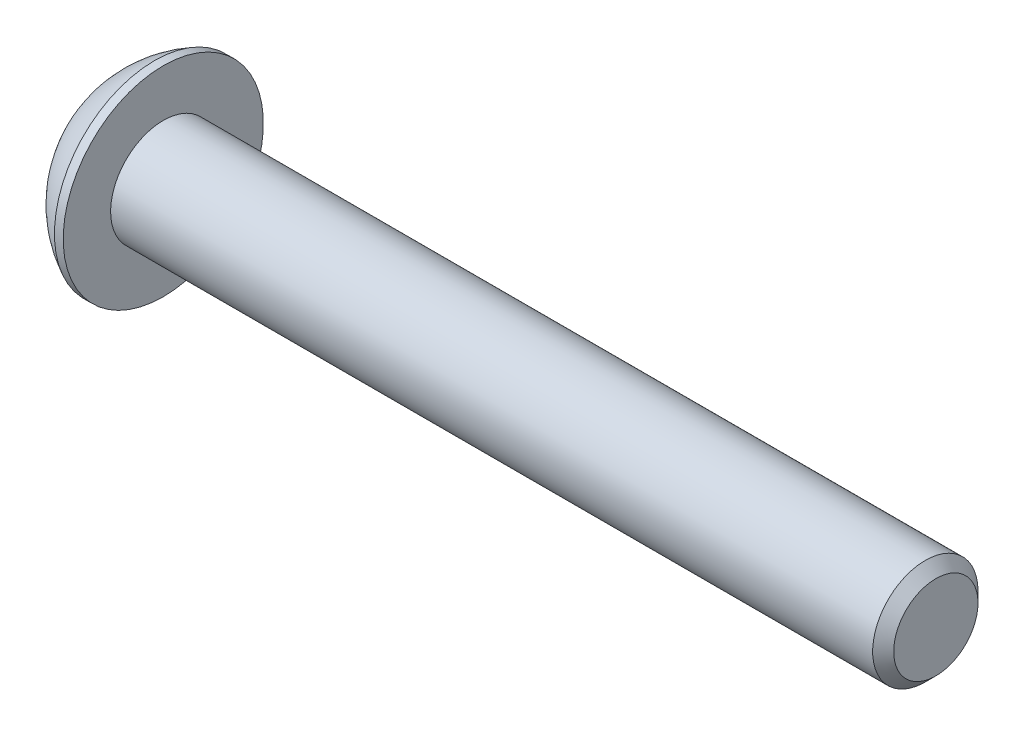
ISO-10303-21;
HEADER;
FILE_DESCRIPTION(('STEP AP214'),'2;1');
FILE_NAME('part.step','',(''),(''),'','','');
FILE_SCHEMA(('AUTOMOTIVE_DESIGN { 1 0 10303 214 1 1 1 1 }'));
ENDSEC;
DATA;
#1=APPLICATION_CONTEXT('core data for automotive mechanical design processes');
#2=APPLICATION_PROTOCOL_DEFINITION('international standard','automotive_design',2000,#1);
#3=PRODUCT_CONTEXT('',#1,'mechanical');
#4=PRODUCT('Part','Part','',(#3));
#5=PRODUCT_RELATED_PRODUCT_CATEGORY('part','',(#4));
#6=PRODUCT_DEFINITION_FORMATION('','',#4);
#7=PRODUCT_DEFINITION_CONTEXT('part definition',#1,'design');
#8=PRODUCT_DEFINITION('design','',#6,#7);
#9=PRODUCT_DEFINITION_SHAPE('','',#8);
#10=(LENGTH_UNIT() NAMED_UNIT(*) SI_UNIT(.MILLI.,.METRE.));
#11=(NAMED_UNIT(*) PLANE_ANGLE_UNIT() SI_UNIT($,.RADIAN.));
#12=(NAMED_UNIT(*) SI_UNIT($,.STERADIAN.) SOLID_ANGLE_UNIT());
#13=UNCERTAINTY_MEASURE_WITH_UNIT(LENGTH_MEASURE(1.E-05),#10,'distance_accuracy_value','');
#14=(GEOMETRIC_REPRESENTATION_CONTEXT(3) GLOBAL_UNCERTAINTY_ASSIGNED_CONTEXT((#13)) GLOBAL_UNIT_ASSIGNED_CONTEXT((#10,
#11,#12)) REPRESENTATION_CONTEXT('',''));
#15=CARTESIAN_POINT('',(0.,0.,0.));
#16=DIRECTION('',(0.,0.,1.));
#17=DIRECTION('',(1.,0.,0.));
#18=AXIS2_PLACEMENT_3D('',#15,#16,#17);
#19=CARTESIAN_POINT('',(-22.,0.,0.));
#20=DIRECTION('',(1.,0.,0.));
#21=DIRECTION('',(0.,0.,-1.));
#22=AXIS2_PLACEMENT_3D('',#19,#20,#21);
#23=CYLINDRICAL_SURFACE('',#22,1.5);
#24=CARTESIAN_POINT('',(-0.300000000000002,0.,0.));
#25=DIRECTION('',(1.,0.,0.));
#26=DIRECTION('',(0.,0.,-1.));
#27=AXIS2_PLACEMENT_3D('',#24,#25,#26);
#28=CIRCLE('',#27,1.5);
#29=CARTESIAN_POINT('',(-0.300000000000002,0.,-1.5));
#30=VERTEX_POINT('',#29);
#31=EDGE_CURVE('E48',#30,#30,#28,.F.);
#32=ORIENTED_EDGE('',*,*,#31,.T.);
#33=EDGE_LOOP('',(#32));
#34=FACE_BOUND('',#33,.T.);
#35=CARTESIAN_POINT('',(-22.,0.,0.));
#36=DIRECTION('',(-1.,0.,0.));
#37=DIRECTION('',(0.,-1.,0.));
#38=AXIS2_PLACEMENT_3D('',#35,#36,#37);
#39=CIRCLE('',#38,1.5);
#40=CARTESIAN_POINT('',(-22.,-1.50000000000001,0.));
#41=VERTEX_POINT('',#40);
#42=EDGE_CURVE('E131',#41,#41,#39,.F.);
#43=ORIENTED_EDGE('',*,*,#42,.T.);
#44=EDGE_LOOP('',(#43));
#45=FACE_BOUND('',#44,.T.);
#46=ADVANCED_FACE('F35',(#34,#45),#23,.T.);
#47=CARTESIAN_POINT('',(0.,0.,0.));
#48=DIRECTION('',(1.,0.,0.));
#49=DIRECTION('',(0.,0.,-1.));
#50=AXIS2_PLACEMENT_3D('',#47,#48,#49);
#51=PLANE('',#50);
#52=CARTESIAN_POINT('',(0.,0.,0.));
#53=DIRECTION('',(1.,0.,0.));
#54=DIRECTION('',(0.,0.,-1.));
#55=AXIS2_PLACEMENT_3D('',#52,#53,#54);
#56=CIRCLE('',#55,1.2);
#57=CARTESIAN_POINT('',(0.,0.,-1.2));
#58=VERTEX_POINT('',#57);
#59=EDGE_CURVE('E135',#58,#58,#56,.T.);
#60=ORIENTED_EDGE('',*,*,#59,.T.);
#61=EDGE_LOOP('',(#60));
#62=FACE_BOUND('',#61,.T.);
#63=ADVANCED_FACE('F150',(#62),#51,.T.);
#64=CARTESIAN_POINT('',(0.,0.,0.));
#65=DIRECTION('',(-1.,0.,0.));
#66=DIRECTION('',(0.,0.,1.));
#67=AXIS2_PLACEMENT_3D('',#64,#65,#66);
#68=CONICAL_SURFACE('',#67,1.2,0.785398163397452);
#69=ORIENTED_EDGE('',*,*,#31,.F.);
#70=EDGE_LOOP('',(#69));
#71=FACE_BOUND('',#70,.T.);
#72=ORIENTED_EDGE('',*,*,#59,.F.);
#73=EDGE_LOOP('',(#72));
#74=FACE_BOUND('',#73,.T.);
#75=ADVANCED_FACE('F37',(#71,#74),#68,.T.);
#76=CARTESIAN_POINT('',(-23.65,0.,0.));
#77=DIRECTION('',(1.,0.,0.));
#78=DIRECTION('',(0.,1.,0.));
#79=AXIS2_PLACEMENT_3D('',#76,#77,#78);
#80=PLANE('',#79);
#81=CARTESIAN_POINT('',(-23.65,0.,0.));
#82=DIRECTION('',(-1.,0.,0.));
#83=DIRECTION('',(0.,-1.,0.));
#84=AXIS2_PLACEMENT_3D('',#81,#82,#83);
#85=CIRCLE('',#84,1.20470053837925);
#86=CARTESIAN_POINT('',(-23.65,-1.20470053837923,0.));
#87=VERTEX_POINT('',#86);
#88=EDGE_CURVE('E373',#87,#87,#85,.T.);
#89=ORIENTED_EDGE('',*,*,#88,.F.);
#90=EDGE_LOOP('',(#89));
#91=FACE_BOUND('',#90,.T.);
#92=CARTESIAN_POINT('',(-23.65,0.,0.));
#93=DIRECTION('',(-1.,0.,0.));
#94=DIRECTION('',(0.,-1.,0.));
#95=AXIS2_PLACEMENT_3D('',#92,#93,#94);
#96=CIRCLE('',#95,1.5);
#97=CARTESIAN_POINT('',(-23.65,-1.5,0.));
#98=VERTEX_POINT('',#97);
#99=EDGE_CURVE('E127',#98,#98,#96,.T.);
#100=ORIENTED_EDGE('',*,*,#99,.T.);
#101=EDGE_LOOP('',(#100));
#102=FACE_BOUND('',#101,.T.);
#103=ADVANCED_FACE('F149',(#91,#102),#80,.F.);
#104=CARTESIAN_POINT('',(-20.8526785714286,0.,0.));
#105=DIRECTION('',(-1.,0.,0.));
#106=DIRECTION('',(0.,1.,0.));
#107=AXIS2_PLACEMENT_3D('',#104,#105,#106);
#108=SPHERICAL_SURFACE('',#107,3.17411517981703);
#109=ORIENTED_EDGE('',*,*,#99,.F.);
#110=EDGE_LOOP('',(#109));
#111=FACE_BOUND('',#110,.T.);
#112=CARTESIAN_POINT('',(-22.25,0.,0.));
#113=DIRECTION('',(-1.,0.,0.));
#114=DIRECTION('',(0.,-1.,0.));
#115=AXIS2_PLACEMENT_3D('',#112,#113,#114);
#116=CIRCLE('',#115,2.85);
#117=CARTESIAN_POINT('',(-22.25,-2.85,0.));
#118=VERTEX_POINT('',#117);
#119=EDGE_CURVE('E123',#118,#118,#116,.T.);
#120=ORIENTED_EDGE('',*,*,#119,.T.);
#121=EDGE_LOOP('',(#120));
#122=FACE_BOUND('',#121,.T.);
#123=ADVANCED_FACE('F161',(#111,#122),#108,.T.);
#124=CARTESIAN_POINT('',(-22.,0.,0.));
#125=DIRECTION('',(-1.,0.,0.));
#126=DIRECTION('',(0.,-1.,0.));
#127=AXIS2_PLACEMENT_3D('',#124,#125,#126);
#128=CYLINDRICAL_SURFACE('',#127,2.85);
#129=ORIENTED_EDGE('',*,*,#119,.F.);
#130=EDGE_LOOP('',(#129));
#131=FACE_BOUND('',#130,.T.);
#132=CARTESIAN_POINT('',(-22.,0.,0.));
#133=DIRECTION('',(-1.,0.,0.));
#134=DIRECTION('',(0.,-1.,0.));
#135=AXIS2_PLACEMENT_3D('',#132,#133,#134);
#136=CIRCLE('',#135,2.85);
#137=CARTESIAN_POINT('',(-22.,-2.85,0.));
#138=VERTEX_POINT('',#137);
#139=EDGE_CURVE('E119',#138,#138,#136,.T.);
#140=ORIENTED_EDGE('',*,*,#139,.T.);
#141=EDGE_LOOP('',(#140));
#142=FACE_BOUND('',#141,.T.);
#143=ADVANCED_FACE('F165',(#131,#142),#128,.T.);
#144=CARTESIAN_POINT('',(-22.,2.85,0.));
#145=DIRECTION('',(-1.,0.,0.));
#146=DIRECTION('',(0.,-1.,0.));
#147=AXIS2_PLACEMENT_3D('',#144,#145,#146);
#148=PLANE('',#147);
#149=ORIENTED_EDGE('',*,*,#42,.F.);
#150=EDGE_LOOP('',(#149));
#151=FACE_BOUND('',#150,.T.);
#152=ORIENTED_EDGE('',*,*,#139,.F.);
#153=EDGE_LOOP('',(#152));
#154=FACE_BOUND('',#153,.T.);
#155=ADVANCED_FACE('F169',(#151,#154),#148,.F.);
#156=CARTESIAN_POINT('',(-23.65,0.,0.));
#157=DIRECTION('',(-1.,0.,0.));
#158=DIRECTION('',(0.,-1.,0.));
#159=AXIS2_PLACEMENT_3D('',#156,#157,#158);
#160=CONICAL_SURFACE('',#159,1.20470053837925,0.78539816339745);
#161=ORIENTED_EDGE('',*,*,#88,.T.);
#162=EDGE_LOOP('',(#161));
#163=FACE_BOUND('',#162,.T.);
#164=CARTESIAN_POINT('',(-24.0125645579163,-1.20678079288094,1.));
#165=CARTESIAN_POINT('',(-23.9901238799752,-1.17763239380935,1.));
#166=CARTESIAN_POINT('',(-23.9678867609271,-1.14832777655036,1.));
#167=CARTESIAN_POINT('',(-23.9239053230859,-1.08934073997338,1.));
#168=CARTESIAN_POINT('',(-23.902161120887,-1.05965823380993,1.));
#169=CARTESIAN_POINT('',(-23.8374858802222,-0.969511619364356,1.));
#170=CARTESIAN_POINT('',(-23.795456442765,-0.908390032886386,1.));
#171=CARTESIAN_POINT('',(-23.7124203349119,-0.779849899214012,1.));
#172=CARTESIAN_POINT('',(-23.6716484956871,-0.712278047733941,1.));
#173=CARTESIAN_POINT('',(-23.5967056855402,-0.573692441836158,1.));
#174=CARTESIAN_POINT('',(-23.5625124208036,-0.50269137003357,1.));
#175=CARTESIAN_POINT('',(-23.5206648240494,-0.396633108483649,1.));
#176=CARTESIAN_POINT('',(-23.5087524246011,-0.363265114723077,1.));
#177=CARTESIAN_POINT('',(-23.4876010580815,-0.295675144863674,1.));
#178=CARTESIAN_POINT('',(-23.4783622608543,-0.261453114661014,1.));
#179=CARTESIAN_POINT('',(-23.4632108375931,-0.192964714439408,1.));
#180=CARTESIAN_POINT('',(-23.4572372079353,-0.158712062702413,1.));
#181=CARTESIAN_POINT('',(-23.4487381792859,-0.089767898959771,1.));
#182=CARTESIAN_POINT('',(-23.4462131691607,-0.0550763379077727,1.));
#183=CARTESIAN_POINT('',(-23.4448308242394,0.0128534343372197,1.));
#184=CARTESIAN_POINT('',(-23.4458171333425,0.0460884918414852,1.));
#185=CARTESIAN_POINT('',(-23.4510428296463,0.112288777523373,1.));
#186=CARTESIAN_POINT('',(-23.4552814228284,0.145254069576946,1.));
#187=CARTESIAN_POINT('',(-23.4668431932388,0.211252641710492,1.));
#188=CARTESIAN_POINT('',(-23.4742213991969,0.244276126106436,1.));
#189=CARTESIAN_POINT('',(-23.4916537633013,0.309593416178925,1.));
#190=CARTESIAN_POINT('',(-23.5017077720937,0.341887262472155,1.));
#191=CARTESIAN_POINT('',(-23.5364692676108,0.441188556116734,1.));
#192=CARTESIAN_POINT('',(-23.5650343603337,0.506841480843505,1.));
#193=CARTESIAN_POINT('',(-23.6286033694253,0.635081389212392,1.));
#194=CARTESIAN_POINT('',(-23.663629955309,0.697656564069552,1.));
#195=CARTESIAN_POINT('',(-23.7359546107891,0.817274369694641,1.));
#196=CARTESIAN_POINT('',(-23.7730556162911,0.874437672313609,1.));
#197=CARTESIAN_POINT('',(-23.8304371678966,0.958655710303513,1.));
#198=CARTESIAN_POINT('',(-23.8497720189249,0.98636616376698,1.));
#199=CARTESIAN_POINT('',(-23.8889602713879,1.04140691974412,1.));
#200=CARTESIAN_POINT('',(-23.908813529201,1.06873732439884,1.));
#201=CARTESIAN_POINT('',(-23.92888195229,1.09590921458872,1.));
#202=B_SPLINE_CURVE_WITH_KNOTS('',3,(#164,#165,#166,#167,#168,#169,#170,#171,#172,#173,#174,
#175,#176,#177,#178,#179,#180,#181,#182,#183,#184,#185,#186,#187,#188,#189,#190,#191,#192,#193,
#194,#195,#196,#197,#198,#199,#200,#201),.UNSPECIFIED.,.F.,.F.,(4,2,2,2,2,2,2,2,2,2,2,2,2,2,2,2,
2,2,4),(0.,0.110355487284535,0.220736811203827,0.443178348562912,0.679759335181115,
0.915523888816459,1.02172703810024,1.12793693259619,1.23208803653002,1.33625088357216,
1.43583459192534,1.53539399546241,1.63677534642523,1.73815103982915,1.95232008261278,
2.16725532249797,2.37159620059983,2.47295962852456,2.57429526618464),.UNSPECIFIED.);
#203=CARTESIAN_POINT('',(-23.6,-0.577350269189611,1.));
#204=VERTEX_POINT('',#203);
#205=CARTESIAN_POINT('',(-23.6,0.577350269189642,1.));
#206=VERTEX_POINT('',#205);
#207=EDGE_CURVE('E103',#204,#206,#202,.T.);
#208=ORIENTED_EDGE('',*,*,#207,.F.);
#209=CARTESIAN_POINT('',(-23.6001154873726,-1.15481600843307,-0.000200000000000398));
#210=CARTESIAN_POINT('',(-23.5802779308257,-1.13496520795024,0.0341825950071799));
#211=CARTESIAN_POINT('',(-23.5616050206389,-1.11478247255941,0.0691401181398245));
#212=CARTESIAN_POINT('',(-23.5274147427232,-1.07362739529218,0.14042280295609));
#213=CARTESIAN_POINT('',(-23.5119164090235,-1.05265113558078,0.176754750528984));
#214=CARTESIAN_POINT('',(-23.4853673071423,-1.01035337909802,0.250016613803311));
#215=CARTESIAN_POINT('',(-23.4742497739969,-0.989042666109225,0.286927851445414));
#216=CARTESIAN_POINT('',(-23.4571198657762,-0.945952199282676,0.361562729310859));
#217=CARTESIAN_POINT('',(-23.4510946974667,-0.924173762626581,0.399284088108635));
#218=CARTESIAN_POINT('',(-23.4456605549675,-0.886641312639999,0.464292198417933));
#219=CARTESIAN_POINT('',(-23.4448569383167,-0.870936130672261,0.491494371528171));
#220=CARTESIAN_POINT('',(-23.4462066994169,-0.839556179862833,0.545846040669112));
#221=CARTESIAN_POINT('',(-23.4483607295472,-0.823881418494909,0.572995523754875));
#222=CARTESIAN_POINT('',(-23.4591169721285,-0.777080970599352,0.65405627732696));
#223=CARTESIAN_POINT('',(-23.4720145564154,-0.746188191116416,0.707564140978427));
#224=CARTESIAN_POINT('',(-23.5031407306022,-0.691968116419635,0.801476065143431));
#225=CARTESIAN_POINT('',(-23.5197377977018,-0.668386557293357,0.842320523671834));
#226=CARTESIAN_POINT('',(-23.5571249246853,-0.622147085933667,0.922409637381943));
#227=CARTESIAN_POINT('',(-23.5779013418174,-0.599486449584561,0.961659010870437));
#228=CARTESIAN_POINT('',(-23.6001154873726,-0.577234799135774,1.0002));
#229=B_SPLINE_CURVE_WITH_KNOTS('',3,(#209,#210,#211,#212,#213,#214,#215,#216,#217,#218,#219,
#220,#221,#222,#223,#224,#225,#226,#227,#228),.UNSPECIFIED.,.F.,.F.,(4,2,2,2,2,2,2,2,2,4),(0.,
0.13323767682856,0.26725222983449,0.399137076269299,0.530689603280767,0.624814864263845,
0.718960890149132,0.907306626112096,1.05710100361789,1.20641411519286),.UNSPECIFIED.);
#230=CARTESIAN_POINT('',(-23.6,-1.15470053837924,0.));
#231=VERTEX_POINT('',#230);
#232=EDGE_CURVE('E211',#231,#204,#229,.T.);
#233=ORIENTED_EDGE('',*,*,#232,.F.);
#234=CARTESIAN_POINT('',(-23.6001154873726,-0.577234799135773,-1.0002));
#235=CARTESIAN_POINT('',(-23.5802779308257,-0.597085599618607,-0.965817404992819));
#236=CARTESIAN_POINT('',(-23.5616050206389,-0.617268335009442,-0.930859881860174));
#237=CARTESIAN_POINT('',(-23.5274147427232,-0.658423412276671,-0.85957719704391));
#238=CARTESIAN_POINT('',(-23.5119164090235,-0.679399671988065,-0.823245249471015));
#239=CARTESIAN_POINT('',(-23.4853673071423,-0.721697428470832,-0.749983386196689));
#240=CARTESIAN_POINT('',(-23.4742497739969,-0.743008141459622,-0.713072148554586));
#241=CARTESIAN_POINT('',(-23.4571198657762,-0.786098608286171,-0.638437270689141));
#242=CARTESIAN_POINT('',(-23.4510946974667,-0.807877044942266,-0.600715911891364));
#243=CARTESIAN_POINT('',(-23.4456605549675,-0.845409494928848,-0.535707801582067));
#244=CARTESIAN_POINT('',(-23.4448569383167,-0.861114676896587,-0.508505628471828));
#245=CARTESIAN_POINT('',(-23.4462066994169,-0.892494627706014,-0.454153959330888));
#246=CARTESIAN_POINT('',(-23.4483607295472,-0.908169389073939,-0.427004476245125));
#247=CARTESIAN_POINT('',(-23.4591169721285,-0.954969836969496,-0.34594372267304));
#248=CARTESIAN_POINT('',(-23.4720145564154,-0.985862616452432,-0.292435859021573));
#249=CARTESIAN_POINT('',(-23.5031407306022,-1.04008269114921,-0.198523934856569));
#250=CARTESIAN_POINT('',(-23.5197377977018,-1.06366425027549,-0.157679476328166));
#251=CARTESIAN_POINT('',(-23.5571249246853,-1.10990372163518,-0.0775903626180572));
#252=CARTESIAN_POINT('',(-23.5779013418174,-1.13256435798429,-0.0383409891295636));
#253=CARTESIAN_POINT('',(-23.6001154873726,-1.15481600843307,0.000199999999998404));
#254=B_SPLINE_CURVE_WITH_KNOTS('',3,(#234,#235,#236,#237,#238,#239,#240,#241,#242,#243,#244,
#245,#246,#247,#248,#249,#250,#251,#252,#253),.UNSPECIFIED.,.F.,.F.,(4,2,2,2,2,2,2,2,2,4),(0.,
0.133237676828559,0.26725222983449,0.399137076269299,0.530689603280767,0.624814864263845,
0.718960890149132,0.907306626112096,1.05710100361789,1.20641411519286),.UNSPECIFIED.);
#255=CARTESIAN_POINT('',(-23.6,-0.57735026918961,-1.));
#256=VERTEX_POINT('',#255);
#257=EDGE_CURVE('E206',#256,#231,#254,.T.);
#258=ORIENTED_EDGE('',*,*,#257,.F.);
#259=CARTESIAN_POINT('',(-24.0125645579163,-1.20678079288094,-1.));
#260=CARTESIAN_POINT('',(-23.9901238799752,-1.17763239380935,-1.));
#261=CARTESIAN_POINT('',(-23.9678867609271,-1.14832777655036,-1.));
#262=CARTESIAN_POINT('',(-23.9239053230859,-1.08934073997338,-1.));
#263=CARTESIAN_POINT('',(-23.902161120887,-1.05965823380993,-1.));
#264=CARTESIAN_POINT('',(-23.8374858802222,-0.969511619364356,-1.));
#265=CARTESIAN_POINT('',(-23.795456442765,-0.908390032886387,-1.));
#266=CARTESIAN_POINT('',(-23.7124203349119,-0.779849899214012,-1.));
#267=CARTESIAN_POINT('',(-23.6716484956871,-0.712278047733939,-1.));
#268=CARTESIAN_POINT('',(-23.5967056855402,-0.573692441836156,-1.));
#269=CARTESIAN_POINT('',(-23.5625124208036,-0.502691370033568,-1.));
#270=CARTESIAN_POINT('',(-23.5206648240494,-0.396633108483647,-1.));
#271=CARTESIAN_POINT('',(-23.5087524246011,-0.363265114723075,-1.));
#272=CARTESIAN_POINT('',(-23.4876010580815,-0.295675144863672,-1.));
#273=CARTESIAN_POINT('',(-23.4783622608543,-0.261453114661012,-1.));
#274=CARTESIAN_POINT('',(-23.4632108375931,-0.192964714439408,-1.));
#275=CARTESIAN_POINT('',(-23.4572372079353,-0.158712062702412,-1.));
#276=CARTESIAN_POINT('',(-23.4487381792859,-0.0897678989597704,-1.));
#277=CARTESIAN_POINT('',(-23.4462131691607,-0.0550763379077722,-1.));
#278=CARTESIAN_POINT('',(-23.4448308242394,0.0128534343372197,-1.));
#279=CARTESIAN_POINT('',(-23.4458171333425,0.0460884918414848,-1.));
#280=CARTESIAN_POINT('',(-23.4510428296463,0.112288777523372,-1.));
#281=CARTESIAN_POINT('',(-23.4552814228284,0.145254069576944,-1.));
#282=CARTESIAN_POINT('',(-23.4668431932388,0.211252641710491,-1.));
#283=CARTESIAN_POINT('',(-23.4742213991969,0.244276126106434,-1.));
#284=CARTESIAN_POINT('',(-23.4916537633013,0.309593416178924,-1.));
#285=CARTESIAN_POINT('',(-23.5017077720937,0.341887262472154,-1.));
#286=CARTESIAN_POINT('',(-23.5364692676108,0.441188556116732,-1.));
#287=CARTESIAN_POINT('',(-23.5650343603337,0.506841480843504,-1.));
#288=CARTESIAN_POINT('',(-23.6286033694253,0.63508138921239,-1.));
#289=CARTESIAN_POINT('',(-23.663629955309,0.697656564069548,-1.));
#290=CARTESIAN_POINT('',(-23.7359546107891,0.817274369694637,-1.));
#291=CARTESIAN_POINT('',(-23.7730556162911,0.874437672313605,-1.));
#292=CARTESIAN_POINT('',(-23.8304371678966,0.958655710303508,-1.));
#293=CARTESIAN_POINT('',(-23.8497720189249,0.986366163766975,-1.));
#294=CARTESIAN_POINT('',(-23.8889602713879,1.04140691974412,-1.));
#295=CARTESIAN_POINT('',(-23.908813529201,1.06873732439884,-1.));
#296=CARTESIAN_POINT('',(-23.92888195229,1.09590921458872,-1.));
#297=B_SPLINE_CURVE_WITH_KNOTS('',3,(#259,#260,#261,#262,#263,#264,#265,#266,#267,#268,#269,
#270,#271,#272,#273,#274,#275,#276,#277,#278,#279,#280,#281,#282,#283,#284,#285,#286,#287,#288,
#289,#290,#291,#292,#293,#294,#295,#296),.UNSPECIFIED.,.F.,.F.,(4,2,2,2,2,2,2,2,2,2,2,2,2,2,2,2,
2,2,4),(0.,0.110355487284534,0.220736811203826,0.443178348562909,0.679759335181114,
0.915523888816459,1.02172703810024,1.12793693259619,1.23208803653002,1.33625088357216,
1.43583459192534,1.5353939954624,1.63677534642523,1.73815103982915,1.95232008261277,
2.16725532249796,2.37159620059982,2.47295962852455,2.57429526618463),.UNSPECIFIED.);
#298=CARTESIAN_POINT('',(-23.6,0.577350269189642,-1.));
#299=VERTEX_POINT('',#298);
#300=EDGE_CURVE('E55',#299,#256,#297,.F.);
#301=ORIENTED_EDGE('',*,*,#300,.F.);
#302=CARTESIAN_POINT('',(-23.6001154873726,1.15481600843311,0.000199999999999837));
#303=CARTESIAN_POINT('',(-23.5802779308257,1.13496520795027,-0.0341825950071814));
#304=CARTESIAN_POINT('',(-23.5616050206389,1.11478247255944,-0.0691401181398258));
#305=CARTESIAN_POINT('',(-23.5274147427232,1.07362739529221,-0.140422802956091));
#306=CARTESIAN_POINT('',(-23.5119164090235,1.05265113558081,-0.176754750528985));
#307=CARTESIAN_POINT('',(-23.4853673071423,1.01035337909805,-0.250016613803312));
#308=CARTESIAN_POINT('',(-23.4742497739969,0.989042666109256,-0.286927851445415));
#309=CARTESIAN_POINT('',(-23.4571198657762,0.945952199282707,-0.36156272931086));
#310=CARTESIAN_POINT('',(-23.4510946974667,0.924173762626612,-0.399284088108636));
#311=CARTESIAN_POINT('',(-23.4456605549675,0.88664131264003,-0.464292198417934));
#312=CARTESIAN_POINT('',(-23.4448569383167,0.870936130672291,-0.491494371528172));
#313=CARTESIAN_POINT('',(-23.4462066994169,0.839556179862864,-0.545846040669112));
#314=CARTESIAN_POINT('',(-23.4483607295472,0.823881418494939,-0.572995523754876));
#315=CARTESIAN_POINT('',(-23.4591169721285,0.777080970599382,-0.654056277326961));
#316=CARTESIAN_POINT('',(-23.4720145564154,0.746188191116446,-0.707564140978428));
#317=CARTESIAN_POINT('',(-23.5031407306022,0.691968116419665,-0.801476065143431));
#318=CARTESIAN_POINT('',(-23.5197377977018,0.668386557293388,-0.842320523671834));
#319=CARTESIAN_POINT('',(-23.5571249246853,0.622147085933698,-0.922409637381943));
#320=CARTESIAN_POINT('',(-23.5779013418174,0.599486449584592,-0.961659010870437));
#321=CARTESIAN_POINT('',(-23.6001154873726,0.577234799135804,-1.0002));
#322=B_SPLINE_CURVE_WITH_KNOTS('',3,(#302,#303,#304,#305,#306,#307,#308,#309,#310,#311,#312,
#313,#314,#315,#316,#317,#318,#319,#320,#321),.UNSPECIFIED.,.F.,.F.,(4,2,2,2,2,2,2,2,2,4),(0.,
0.133237676828559,0.26725222983449,0.3991370762693,0.530689603280768,0.624814864263845,
0.718960890149133,0.907306626112097,1.05710100361789,1.20641411519286),.UNSPECIFIED.);
#323=CARTESIAN_POINT('',(-23.6,1.15470053837927,0.));
#324=VERTEX_POINT('',#323);
#325=EDGE_CURVE('E11',#324,#299,#322,.T.);
#326=ORIENTED_EDGE('',*,*,#325,.F.);
#327=CARTESIAN_POINT('',(-23.6001154873726,0.577234799135804,1.0002));
#328=CARTESIAN_POINT('',(-23.5802779308257,0.597085599618637,0.965817404992819));
#329=CARTESIAN_POINT('',(-23.5616050206389,0.617268335009472,0.930859881860175));
#330=CARTESIAN_POINT('',(-23.5274147427232,0.658423412276702,0.859577197043909));
#331=CARTESIAN_POINT('',(-23.5119164090235,0.679399671988096,0.823245249471015));
#332=CARTESIAN_POINT('',(-23.4853673071423,0.721697428470862,0.749983386196688));
#333=CARTESIAN_POINT('',(-23.4742497739969,0.743008141459653,0.713072148554585));
#334=CARTESIAN_POINT('',(-23.4571198657762,0.786098608286202,0.638437270689141));
#335=CARTESIAN_POINT('',(-23.4510946974667,0.807877044942297,0.600715911891364));
#336=CARTESIAN_POINT('',(-23.4456605549675,0.845409494928879,0.535707801582066));
#337=CARTESIAN_POINT('',(-23.4448569383167,0.861114676896618,0.508505628471828));
#338=CARTESIAN_POINT('',(-23.4462066994169,0.892494627706045,0.454153959330888));
#339=CARTESIAN_POINT('',(-23.4483607295472,0.90816938907397,0.427004476245124));
#340=CARTESIAN_POINT('',(-23.4591169721285,0.954969836969527,0.34594372267304));
#341=CARTESIAN_POINT('',(-23.4720145564154,0.985862616452463,0.292435859021573));
#342=CARTESIAN_POINT('',(-23.5031407306022,1.04008269114924,0.198523934856569));
#343=CARTESIAN_POINT('',(-23.5197377977018,1.06366425027552,0.157679476328167));
#344=CARTESIAN_POINT('',(-23.5571249246853,1.10990372163521,0.0775903626180573));
#345=CARTESIAN_POINT('',(-23.5779013418174,1.13256435798432,0.038340989129563));
#346=CARTESIAN_POINT('',(-23.6001154873726,1.1548160084331,-0.000199999999998919));
#347=B_SPLINE_CURVE_WITH_KNOTS('',3,(#327,#328,#329,#330,#331,#332,#333,#334,#335,#336,#337,
#338,#339,#340,#341,#342,#343,#344,#345,#346),.UNSPECIFIED.,.F.,.F.,(4,2,2,2,2,2,2,2,2,4),(0.,
0.13323767682856,0.26725222983449,0.399137076269299,0.530689603280767,0.624814864263845,
0.718960890149132,0.907306626112097,1.05710100361789,1.20641411519286),.UNSPECIFIED.);
#348=EDGE_CURVE('E93',#206,#324,#347,.T.);
#349=ORIENTED_EDGE('',*,*,#348,.F.);
#350=EDGE_LOOP('',(#208,#233,#258,#301,#326,#349));
#351=FACE_BOUND('',#350,.T.);
#352=ADVANCED_FACE('F92',(#163,#351),#160,.F.);
#353=CARTESIAN_POINT('',(-22.45,0.,0.));
#354=DIRECTION('',(-1.,0.,0.));
#355=DIRECTION('',(0.,0.,1.));
#356=AXIS2_PLACEMENT_3D('',#353,#354,#355);
#357=PLANE('',#356);
#358=DIRECTION('',(0.,0.5,-0.866025403784439));
#359=VECTOR('',#358,1.);
#360=CARTESIAN_POINT('',(-22.45,0.577350269189641,1.));
#361=LINE('',#360,#359);
#362=CARTESIAN_POINT('',(-22.45,0.577350269189641,1.));
#363=VERTEX_POINT('',#362);
#364=CARTESIAN_POINT('',(-22.45,1.15470053837927,0.));
#365=VERTEX_POINT('',#364);
#366=EDGE_CURVE('E102',#363,#365,#361,.T.);
#367=ORIENTED_EDGE('',*,*,#366,.T.);
#368=DIRECTION('',(0.,-0.5,-0.866025403784439));
#369=VECTOR('',#368,1.);
#370=CARTESIAN_POINT('',(-22.45,1.15470053837927,0.));
#371=LINE('',#370,#369);
#372=CARTESIAN_POINT('',(-22.45,0.577350269189642,-1.));
#373=VERTEX_POINT('',#372);
#374=EDGE_CURVE('E107',#365,#373,#371,.T.);
#375=ORIENTED_EDGE('',*,*,#374,.T.);
#376=DIRECTION('',(0.,-1.,0.));
#377=VECTOR('',#376,1.);
#378=CARTESIAN_POINT('',(-22.45,0.577350269189642,-1.));
#379=LINE('',#378,#377);
#380=CARTESIAN_POINT('',(-22.45,-0.577350269189611,-1.));
#381=VERTEX_POINT('',#380);
#382=EDGE_CURVE('E237',#373,#381,#379,.T.);
#383=ORIENTED_EDGE('',*,*,#382,.T.);
#384=DIRECTION('',(0.,-0.5,0.866025403784438));
#385=VECTOR('',#384,1.);
#386=CARTESIAN_POINT('',(-22.45,-0.577350269189611,-1.));
#387=LINE('',#386,#385);
#388=CARTESIAN_POINT('',(-22.45,-1.15470053837924,0.));
#389=VERTEX_POINT('',#388);
#390=EDGE_CURVE('E242',#381,#389,#387,.T.);
#391=ORIENTED_EDGE('',*,*,#390,.T.);
#392=DIRECTION('',(0.,0.5,0.866025403784439));
#393=VECTOR('',#392,1.);
#394=CARTESIAN_POINT('',(-22.45,-1.15470053837924,0.));
#395=LINE('',#394,#393);
#396=CARTESIAN_POINT('',(-22.45,-0.577350269189611,1.));
#397=VERTEX_POINT('',#396);
#398=EDGE_CURVE('E115',#389,#397,#395,.T.);
#399=ORIENTED_EDGE('',*,*,#398,.T.);
#400=DIRECTION('',(0.,1.,0.));
#401=VECTOR('',#400,1.);
#402=CARTESIAN_POINT('',(-22.45,-0.577350269189611,1.));
#403=LINE('',#402,#401);
#404=EDGE_CURVE('E110',#397,#363,#403,.T.);
#405=ORIENTED_EDGE('',*,*,#404,.T.);
#406=EDGE_LOOP('',(#367,#375,#383,#391,#399,#405));
#407=FACE_BOUND('',#406,.T.);
#408=ADVANCED_FACE('F193',(#407),#357,.T.);
#409=CARTESIAN_POINT('',(-22.45,1.15470053837927,0.));
#410=DIRECTION('',(0.,0.866025403784439,-0.5));
#411=DIRECTION('',(0.,0.5,0.866025403784439));
#412=AXIS2_PLACEMENT_3D('',#409,#410,#411);
#413=PLANE('',#412);
#414=DIRECTION('',(-1.,0.,0.));
#415=VECTOR('',#414,1.);
#416=CARTESIAN_POINT('',(-22.45,1.15470053837927,0.));
#417=LINE('',#416,#415);
#418=EDGE_CURVE('E99',#365,#324,#417,.T.);
#419=ORIENTED_EDGE('',*,*,#418,.T.);
#420=ORIENTED_EDGE('',*,*,#325,.T.);
#421=DIRECTION('',(-1.,0.,0.));
#422=VECTOR('',#421,1.);
#423=CARTESIAN_POINT('',(-22.45,0.577350269189642,-1.));
#424=LINE('',#423,#422);
#425=EDGE_CURVE('E109',#373,#299,#424,.T.);
#426=ORIENTED_EDGE('',*,*,#425,.F.);
#427=ORIENTED_EDGE('',*,*,#374,.F.);
#428=EDGE_LOOP('',(#419,#420,#426,#427));
#429=FACE_BOUND('',#428,.T.);
#430=ADVANCED_FACE('F105',(#429),#413,.F.);
#431=CARTESIAN_POINT('',(-22.45,0.577350269189642,-1.));
#432=DIRECTION('',(0.,0.,-1.));
#433=DIRECTION('',(-1.,0.,0.));
#434=AXIS2_PLACEMENT_3D('',#431,#432,#433);
#435=PLANE('',#434);
#436=ORIENTED_EDGE('',*,*,#425,.T.);
#437=ORIENTED_EDGE('',*,*,#300,.T.);
#438=DIRECTION('',(-1.,0.,0.));
#439=VECTOR('',#438,1.);
#440=CARTESIAN_POINT('',(-22.45,-0.577350269189611,-1.));
#441=LINE('',#440,#439);
#442=EDGE_CURVE('E112',#381,#256,#441,.T.);
#443=ORIENTED_EDGE('',*,*,#442,.F.);
#444=ORIENTED_EDGE('',*,*,#382,.F.);
#445=EDGE_LOOP('',(#436,#437,#443,#444));
#446=FACE_BOUND('',#445,.T.);
#447=ADVANCED_FACE('F226',(#446),#435,.F.);
#448=CARTESIAN_POINT('',(-22.45,-0.577350269189611,-1.));
#449=DIRECTION('',(0.,-0.866025403784439,-0.5));
#450=DIRECTION('',(0.,0.5,-0.866025403784439));
#451=AXIS2_PLACEMENT_3D('',#448,#449,#450);
#452=PLANE('',#451);
#453=ORIENTED_EDGE('',*,*,#442,.T.);
#454=ORIENTED_EDGE('',*,*,#257,.T.);
#455=DIRECTION('',(-1.,0.,0.));
#456=VECTOR('',#455,1.);
#457=CARTESIAN_POINT('',(-22.45,-1.15470053837924,0.));
#458=LINE('',#457,#456);
#459=EDGE_CURVE('E259',#389,#231,#458,.T.);
#460=ORIENTED_EDGE('',*,*,#459,.F.);
#461=ORIENTED_EDGE('',*,*,#390,.F.);
#462=EDGE_LOOP('',(#453,#454,#460,#461));
#463=FACE_BOUND('',#462,.T.);
#464=ADVANCED_FACE('F221',(#463),#452,.F.);
#465=CARTESIAN_POINT('',(-22.45,-1.15470053837924,0.));
#466=DIRECTION('',(0.,-0.866025403784439,0.5));
#467=DIRECTION('',(0.,-0.5,-0.866025403784439));
#468=AXIS2_PLACEMENT_3D('',#465,#466,#467);
#469=PLANE('',#468);
#470=ORIENTED_EDGE('',*,*,#459,.T.);
#471=ORIENTED_EDGE('',*,*,#232,.T.);
#472=DIRECTION('',(-1.,0.,0.));
#473=VECTOR('',#472,1.);
#474=CARTESIAN_POINT('',(-22.45,-0.577350269189611,1.));
#475=LINE('',#474,#473);
#476=EDGE_CURVE('E256',#397,#204,#475,.T.);
#477=ORIENTED_EDGE('',*,*,#476,.F.);
#478=ORIENTED_EDGE('',*,*,#398,.F.);
#479=EDGE_LOOP('',(#470,#471,#477,#478));
#480=FACE_BOUND('',#479,.T.);
#481=ADVANCED_FACE('F218',(#480),#469,.F.);
#482=CARTESIAN_POINT('',(-22.45,-0.577350269189611,1.));
#483=DIRECTION('',(0.,0.,1.));
#484=DIRECTION('',(1.,0.,0.));
#485=AXIS2_PLACEMENT_3D('',#482,#483,#484);
#486=PLANE('',#485);
#487=ORIENTED_EDGE('',*,*,#476,.T.);
#488=ORIENTED_EDGE('',*,*,#207,.T.);
#489=DIRECTION('',(-1.,0.,0.));
#490=VECTOR('',#489,1.);
#491=CARTESIAN_POINT('',(-22.45,0.577350269189641,1.));
#492=LINE('',#491,#490);
#493=EDGE_CURVE('E62',#363,#206,#492,.T.);
#494=ORIENTED_EDGE('',*,*,#493,.F.);
#495=ORIENTED_EDGE('',*,*,#404,.F.);
#496=EDGE_LOOP('',(#487,#488,#494,#495));
#497=FACE_BOUND('',#496,.T.);
#498=ADVANCED_FACE('F176',(#497),#486,.F.);
#499=CARTESIAN_POINT('',(-22.45,0.577350269189641,1.));
#500=DIRECTION('',(0.,0.866025403784439,0.5));
#501=DIRECTION('',(0.,-0.5,0.866025403784439));
#502=AXIS2_PLACEMENT_3D('',#499,#500,#501);
#503=PLANE('',#502);
#504=ORIENTED_EDGE('',*,*,#493,.T.);
#505=ORIENTED_EDGE('',*,*,#348,.T.);
#506=ORIENTED_EDGE('',*,*,#418,.F.);
#507=ORIENTED_EDGE('',*,*,#366,.F.);
#508=EDGE_LOOP('',(#504,#505,#506,#507));
#509=FACE_BOUND('',#508,.T.);
#510=ADVANCED_FACE('F98',(#509),#503,.F.);
#511=CLOSED_SHELL('',(#46,#63,#75,#103,#123,#143,#155,#352,#408,#430,#447,#464,#481,#498,#510));
#512=MANIFOLD_SOLID_BREP('B2',#511);
#513=ADVANCED_BREP_SHAPE_REPRESENTATION('',(#18,#512),#14);
#514=SHAPE_DEFINITION_REPRESENTATION(#9,#513);
ENDSEC;
END-ISO-10303-21;
